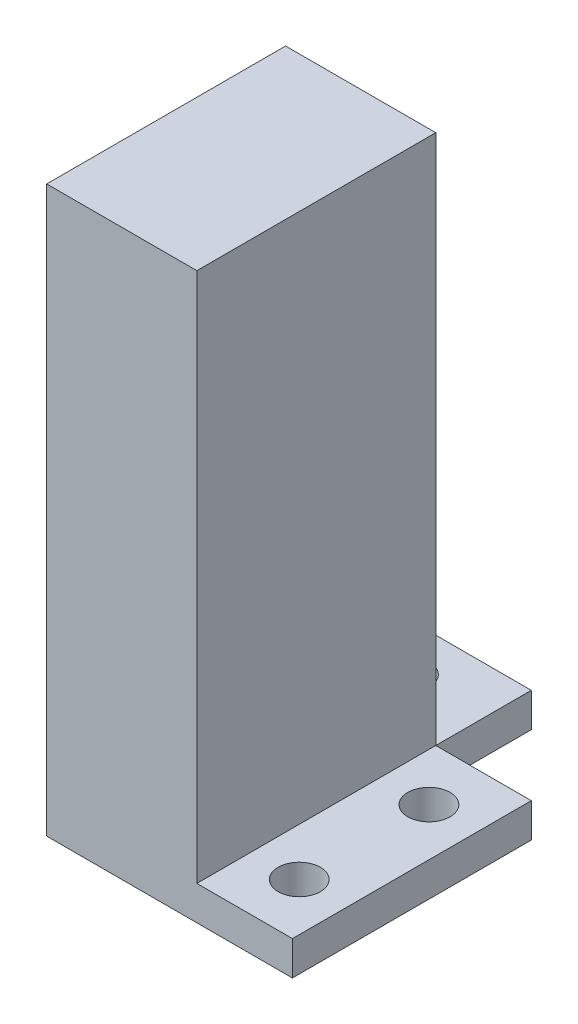
ISO-10303-21;
HEADER;
FILE_DESCRIPTION(('STEP AP214'),'2;1');
FILE_NAME('part.step','',(''),(''),'','','');
FILE_SCHEMA(('AUTOMOTIVE_DESIGN { 1 0 10303 214 1 1 1 1 }'));
ENDSEC;
DATA;
#1=APPLICATION_CONTEXT('core data for automotive mechanical design processes');
#2=APPLICATION_PROTOCOL_DEFINITION('international standard','automotive_design',2000,#1);
#3=PRODUCT_CONTEXT('',#1,'mechanical');
#4=PRODUCT('Part','Part','',(#3));
#5=PRODUCT_RELATED_PRODUCT_CATEGORY('part','',(#4));
#6=PRODUCT_DEFINITION_FORMATION('','',#4);
#7=PRODUCT_DEFINITION_CONTEXT('part definition',#1,'design');
#8=PRODUCT_DEFINITION('design','',#6,#7);
#9=PRODUCT_DEFINITION_SHAPE('','',#8);
#10=(LENGTH_UNIT() NAMED_UNIT(*) SI_UNIT(.MILLI.,.METRE.));
#11=(NAMED_UNIT(*) PLANE_ANGLE_UNIT() SI_UNIT($,.RADIAN.));
#12=(NAMED_UNIT(*) SI_UNIT($,.STERADIAN.) SOLID_ANGLE_UNIT());
#13=UNCERTAINTY_MEASURE_WITH_UNIT(LENGTH_MEASURE(1.E-05),#10,'distance_accuracy_value','');
#14=(GEOMETRIC_REPRESENTATION_CONTEXT(3) GLOBAL_UNCERTAINTY_ASSIGNED_CONTEXT((#13)) GLOBAL_UNIT_ASSIGNED_CONTEXT((#10,
#11,#12)) REPRESENTATION_CONTEXT('',''));
#15=CARTESIAN_POINT('',(0.,0.,0.));
#16=DIRECTION('',(0.,0.,1.));
#17=DIRECTION('',(1.,0.,0.));
#18=AXIS2_PLACEMENT_3D('',#15,#16,#17);
#19=CARTESIAN_POINT('',(11.,49.2196543089587,30.));
#20=DIRECTION('',(-1.,0.,0.));
#21=DIRECTION('',(0.,0.,1.));
#22=AXIS2_PLACEMENT_3D('',#19,#20,#21);
#23=PLANE('',#22);
#24=DIRECTION('',(0.,0.,1.));
#25=VECTOR('',#24,1.);
#26=CARTESIAN_POINT('',(11.,-28.5303456910413,0.));
#27=LINE('',#26,#25);
#28=CARTESIAN_POINT('',(11.,-28.5303456910413,0.));
#29=VERTEX_POINT('',#28);
#30=CARTESIAN_POINT('',(11.,-28.5303456910413,35.));
#31=VERTEX_POINT('',#30);
#32=EDGE_CURVE('E162',#29,#31,#27,.T.);
#33=ORIENTED_EDGE('',*,*,#32,.F.);
#34=DIRECTION('',(0.,1.,0.));
#35=VECTOR('',#34,1.);
#36=CARTESIAN_POINT('',(11.,49.2196543089587,0.));
#37=LINE('',#36,#35);
#38=CARTESIAN_POINT('',(11.,49.2196543089587,0.));
#39=VERTEX_POINT('',#38);
#40=EDGE_CURVE('E240',#29,#39,#37,.T.);
#41=ORIENTED_EDGE('',*,*,#40,.T.);
#42=DIRECTION('',(0.,0.,-1.));
#43=VECTOR('',#42,1.);
#44=CARTESIAN_POINT('',(11.,49.2196543089587,30.));
#45=LINE('',#44,#43);
#46=CARTESIAN_POINT('',(11.,49.2196543089587,35.));
#47=VERTEX_POINT('',#46);
#48=EDGE_CURVE('E243',#47,#39,#45,.T.);
#49=ORIENTED_EDGE('',*,*,#48,.F.);
#50=DIRECTION('',(0.,1.,0.));
#51=VECTOR('',#50,1.);
#52=CARTESIAN_POINT('',(11.,-33.5303456910413,35.));
#53=LINE('',#52,#51);
#54=EDGE_CURVE('E127',#31,#47,#53,.T.);
#55=ORIENTED_EDGE('',*,*,#54,.F.);
#56=EDGE_LOOP('',(#33,#41,#49,#55));
#57=FACE_BOUND('',#56,.T.);
#58=ADVANCED_FACE('F45',(#57),#23,.F.);
#59=CARTESIAN_POINT('',(0.,0.,0.));
#60=DIRECTION('',(0.,0.,1.));
#61=DIRECTION('',(1.,0.,0.));
#62=AXIS2_PLACEMENT_3D('',#59,#60,#61);
#63=PLANE('',#62);
#64=CARTESIAN_POINT('',(0.,7.71965430895869,0.));
#65=DIRECTION('',(0.,0.,1.));
#66=DIRECTION('',(1.,0.,0.));
#67=AXIS2_PLACEMENT_3D('',#64,#65,#66);
#68=CIRCLE('',#67,3.1);
#69=CARTESIAN_POINT('',(3.09999999999998,7.71965430895869,0.));
#70=VERTEX_POINT('',#69);
#71=EDGE_CURVE('E222',#70,#70,#68,.T.);
#72=ORIENTED_EDGE('',*,*,#71,.T.);
#73=EDGE_LOOP('',(#72));
#74=FACE_BOUND('',#73,.T.);
#75=CARTESIAN_POINT('',(0.,35.7196543089587,0.));
#76=DIRECTION('',(0.,0.,1.));
#77=DIRECTION('',(1.,0.,0.));
#78=AXIS2_PLACEMENT_3D('',#75,#76,#77);
#79=CIRCLE('',#78,3.1);
#80=CARTESIAN_POINT('',(3.09999999999998,35.7196543089587,0.));
#81=VERTEX_POINT('',#80);
#82=EDGE_CURVE('E226',#81,#81,#79,.T.);
#83=ORIENTED_EDGE('',*,*,#82,.T.);
#84=EDGE_LOOP('',(#83));
#85=FACE_BOUND('',#84,.T.);
#86=DIRECTION('',(1.,0.,0.));
#87=VECTOR('',#86,1.);
#88=CARTESIAN_POINT('',(0.,-28.5303456910413,0.));
#89=LINE('',#88,#87);
#90=CARTESIAN_POINT('',(-11.,-28.5303456910413,0.));
#91=VERTEX_POINT('',#90);
#92=EDGE_CURVE('E69',#91,#29,#89,.T.);
#93=ORIENTED_EDGE('',*,*,#92,.F.);
#94=DIRECTION('',(0.,-1.,0.));
#95=VECTOR('',#94,1.);
#96=CARTESIAN_POINT('',(-11.,49.2196543089587,0.));
#97=LINE('',#96,#95);
#98=CARTESIAN_POINT('',(-11.,49.2196543089587,0.));
#99=VERTEX_POINT('',#98);
#100=EDGE_CURVE('E237',#99,#91,#97,.T.);
#101=ORIENTED_EDGE('',*,*,#100,.F.);
#102=DIRECTION('',(-1.,0.,0.));
#103=VECTOR('',#102,1.);
#104=CARTESIAN_POINT('',(11.,49.2196543089587,0.));
#105=LINE('',#104,#103);
#106=EDGE_CURVE('E233',#39,#99,#105,.T.);
#107=ORIENTED_EDGE('',*,*,#106,.F.);
#108=ORIENTED_EDGE('',*,*,#40,.F.);
#109=EDGE_LOOP('',(#93,#101,#107,#108));
#110=FACE_BOUND('',#109,.T.);
#111=ADVANCED_FACE('F292',(#74,#85,#110),#63,.F.);
#112=CARTESIAN_POINT('',(11.,49.2196543089587,30.));
#113=DIRECTION('',(0.,-1.,0.));
#114=DIRECTION('',(0.,0.,-1.));
#115=AXIS2_PLACEMENT_3D('',#112,#113,#114);
#116=PLANE('',#115);
#117=ORIENTED_EDGE('',*,*,#106,.T.);
#118=DIRECTION('',(0.,0.,-1.));
#119=VECTOR('',#118,1.);
#120=CARTESIAN_POINT('',(-11.,49.2196543089587,30.));
#121=LINE('',#120,#119);
#122=CARTESIAN_POINT('',(-11.,49.2196543089587,35.));
#123=VERTEX_POINT('',#122);
#124=EDGE_CURVE('E11',#123,#99,#121,.T.);
#125=ORIENTED_EDGE('',*,*,#124,.F.);
#126=DIRECTION('',(-1.,0.,0.));
#127=VECTOR('',#126,1.);
#128=CARTESIAN_POINT('',(11.,49.2196543089587,35.));
#129=LINE('',#128,#127);
#130=EDGE_CURVE('E214',#47,#123,#129,.T.);
#131=ORIENTED_EDGE('',*,*,#130,.F.);
#132=ORIENTED_EDGE('',*,*,#48,.T.);
#133=EDGE_LOOP('',(#117,#125,#131,#132));
#134=FACE_BOUND('',#133,.T.);
#135=ADVANCED_FACE('F47',(#134),#116,.F.);
#136=CARTESIAN_POINT('',(-11.,49.2196543089587,30.));
#137=DIRECTION('',(1.,0.,0.));
#138=DIRECTION('',(0.,0.,-1.));
#139=AXIS2_PLACEMENT_3D('',#136,#137,#138);
#140=PLANE('',#139);
#141=ORIENTED_EDGE('',*,*,#100,.T.);
#142=DIRECTION('',(0.,0.,-1.));
#143=VECTOR('',#142,1.);
#144=CARTESIAN_POINT('',(-11.,-28.5303456910413,0.));
#145=LINE('',#144,#143);
#146=CARTESIAN_POINT('',(-11.,-28.5303456910413,-14.));
#147=VERTEX_POINT('',#146);
#148=EDGE_CURVE('E191',#91,#147,#145,.T.);
#149=ORIENTED_EDGE('',*,*,#148,.T.);
#150=DIRECTION('',(0.,-1.,0.));
#151=VECTOR('',#150,1.);
#152=CARTESIAN_POINT('',(-11.,-28.5303456910413,-14.));
#153=LINE('',#152,#151);
#154=CARTESIAN_POINT('',(-11.,-33.5303456910413,-14.));
#155=VERTEX_POINT('',#154);
#156=EDGE_CURVE('E198',#147,#155,#153,.T.);
#157=ORIENTED_EDGE('',*,*,#156,.T.);
#158=DIRECTION('',(0.,0.,-1.));
#159=VECTOR('',#158,1.);
#160=CARTESIAN_POINT('',(-11.,-33.5303456910413,30.));
#161=LINE('',#160,#159);
#162=CARTESIAN_POINT('',(-11.,-33.5303456910413,35.));
#163=VERTEX_POINT('',#162);
#164=EDGE_CURVE('E54',#163,#155,#161,.T.);
#165=ORIENTED_EDGE('',*,*,#164,.F.);
#166=DIRECTION('',(0.,-1.,0.));
#167=VECTOR('',#166,1.);
#168=CARTESIAN_POINT('',(-11.,49.2196543089587,35.));
#169=LINE('',#168,#167);
#170=EDGE_CURVE('E123',#123,#163,#169,.T.);
#171=ORIENTED_EDGE('',*,*,#170,.F.);
#172=ORIENTED_EDGE('',*,*,#124,.T.);
#173=EDGE_LOOP('',(#141,#149,#157,#165,#171,#172));
#174=FACE_BOUND('',#173,.T.);
#175=ADVANCED_FACE('F252',(#174),#140,.F.);
#176=CARTESIAN_POINT('',(-11.,-33.5303456910413,30.));
#177=DIRECTION('',(0.,1.,0.));
#178=DIRECTION('',(0.,0.,1.));
#179=AXIS2_PLACEMENT_3D('',#176,#177,#178);
#180=PLANE('',#179);
#181=ORIENTED_EDGE('',*,*,#164,.T.);
#182=DIRECTION('',(1.,0.,0.));
#183=VECTOR('',#182,1.);
#184=CARTESIAN_POINT('',(0.,-33.5303456910413,-14.));
#185=LINE('',#184,#183);
#186=CARTESIAN_POINT('',(11.,-33.5303456910413,-14.));
#187=VERTEX_POINT('',#186);
#188=EDGE_CURVE('E147',#155,#187,#185,.T.);
#189=ORIENTED_EDGE('',*,*,#188,.T.);
#190=DIRECTION('',(0.,0.,-1.));
#191=VECTOR('',#190,1.);
#192=CARTESIAN_POINT('',(11.,-33.5303456910413,30.));
#193=LINE('',#192,#191);
#194=CARTESIAN_POINT('',(11.,-33.5303456910413,0.));
#195=VERTEX_POINT('',#194);
#196=EDGE_CURVE('E247',#195,#187,#193,.T.);
#197=ORIENTED_EDGE('',*,*,#196,.F.);
#198=DIRECTION('',(1.,0.,0.));
#199=VECTOR('',#198,1.);
#200=CARTESIAN_POINT('',(0.,-33.5303456910413,0.));
#201=LINE('',#200,#199);
#202=CARTESIAN_POINT('',(25.,-33.5303456910413,0.));
#203=VERTEX_POINT('',#202);
#204=EDGE_CURVE('E61',#195,#203,#201,.T.);
#205=ORIENTED_EDGE('',*,*,#204,.T.);
#206=DIRECTION('',(0.,0.,1.));
#207=VECTOR('',#206,1.);
#208=CARTESIAN_POINT('',(25.,-33.5303456910413,0.));
#209=LINE('',#208,#207);
#210=CARTESIAN_POINT('',(25.,-33.5303456910413,35.));
#211=VERTEX_POINT('',#210);
#212=EDGE_CURVE('E132',#203,#211,#209,.T.);
#213=ORIENTED_EDGE('',*,*,#212,.T.);
#214=DIRECTION('',(1.,0.,0.));
#215=VECTOR('',#214,1.);
#216=CARTESIAN_POINT('',(-11.,-33.5303456910413,35.));
#217=LINE('',#216,#215);
#218=EDGE_CURVE('E116',#163,#211,#217,.T.);
#219=ORIENTED_EDGE('',*,*,#218,.F.);
#220=EDGE_LOOP('',(#181,#189,#197,#205,#213,#219));
#221=FACE_BOUND('',#220,.T.);
#222=CARTESIAN_POINT('',(0.,-33.5303456910413,-7.));
#223=DIRECTION('',(0.,-1.,0.));
#224=DIRECTION('',(0.,0.,-1.));
#225=AXIS2_PLACEMENT_3D('',#222,#223,#224);
#226=CIRCLE('',#225,3.1);
#227=CARTESIAN_POINT('',(0.,-33.5303456910413,-10.1));
#228=VERTEX_POINT('',#227);
#229=EDGE_CURVE('E142',#228,#228,#226,.T.);
#230=ORIENTED_EDGE('',*,*,#229,.F.);
#231=EDGE_LOOP('',(#230));
#232=FACE_BOUND('',#231,.T.);
#233=CARTESIAN_POINT('',(18.,-33.5303456910413,27.));
#234=DIRECTION('',(0.,-1.,0.));
#235=DIRECTION('',(0.,0.,-1.));
#236=AXIS2_PLACEMENT_3D('',#233,#234,#235);
#237=CIRCLE('',#236,3.1);
#238=CARTESIAN_POINT('',(18.,-33.5303456910413,23.9));
#239=VERTEX_POINT('',#238);
#240=EDGE_CURVE('E158',#239,#239,#237,.T.);
#241=ORIENTED_EDGE('',*,*,#240,.F.);
#242=EDGE_LOOP('',(#241));
#243=FACE_BOUND('',#242,.T.);
#244=CARTESIAN_POINT('',(18.,-33.5303456910413,8.));
#245=DIRECTION('',(0.,-1.,0.));
#246=DIRECTION('',(0.,0.,-1.));
#247=AXIS2_PLACEMENT_3D('',#244,#245,#246);
#248=CIRCLE('',#247,3.1);
#249=CARTESIAN_POINT('',(18.,-33.5303456910413,4.9));
#250=VERTEX_POINT('',#249);
#251=EDGE_CURVE('E154',#250,#250,#248,.T.);
#252=ORIENTED_EDGE('',*,*,#251,.F.);
#253=EDGE_LOOP('',(#252));
#254=FACE_BOUND('',#253,.T.);
#255=ADVANCED_FACE('F138',(#221,#232,#243,#254),#180,.F.);
#256=DIRECTION('',(0.,0.,-1.));
#257=VECTOR('',#256,1.);
#258=CARTESIAN_POINT('',(11.,-28.5303456910413,0.));
#259=LINE('',#258,#257);
#260=CARTESIAN_POINT('',(11.,-28.5303456910413,-14.));
#261=VERTEX_POINT('',#260);
#262=EDGE_CURVE('E186',#29,#261,#259,.T.);
#263=ORIENTED_EDGE('',*,*,#262,.F.);
#264=DIRECTION('',(0.,-1.,0.));
#265=VECTOR('',#264,1.);
#266=CARTESIAN_POINT('',(11.,-28.5303456910413,0.));
#267=LINE('',#266,#265);
#268=EDGE_CURVE('E152',#29,#195,#267,.T.);
#269=ORIENTED_EDGE('',*,*,#268,.T.);
#270=ORIENTED_EDGE('',*,*,#196,.T.);
#271=DIRECTION('',(0.,-1.,0.));
#272=VECTOR('',#271,1.);
#273=CARTESIAN_POINT('',(11.,-28.5303456910413,-14.));
#274=LINE('',#273,#272);
#275=EDGE_CURVE('E203',#261,#187,#274,.T.);
#276=ORIENTED_EDGE('',*,*,#275,.F.);
#277=EDGE_LOOP('',(#263,#269,#270,#276));
#278=FACE_BOUND('',#277,.T.);
#279=ADVANCED_FACE('F260',(#278),#23,.F.);
#280=CARTESIAN_POINT('',(0.,35.7196543089587,30.));
#281=DIRECTION('',(0.,0.,-1.));
#282=DIRECTION('',(-1.,0.,0.));
#283=AXIS2_PLACEMENT_3D('',#280,#281,#282);
#284=CYLINDRICAL_SURFACE('',#283,3.1);
#285=CARTESIAN_POINT('',(0.,35.7196543089587,30.));
#286=DIRECTION('',(0.,0.,1.));
#287=DIRECTION('',(1.,0.,0.));
#288=AXIS2_PLACEMENT_3D('',#285,#286,#287);
#289=CIRCLE('',#288,3.1);
#290=CARTESIAN_POINT('',(3.09999999999998,35.7196543089587,30.));
#291=VERTEX_POINT('',#290);
#292=EDGE_CURVE('E221',#291,#291,#289,.T.);
#293=ORIENTED_EDGE('',*,*,#292,.T.);
#294=EDGE_LOOP('',(#293));
#295=FACE_BOUND('',#294,.T.);
#296=ORIENTED_EDGE('',*,*,#82,.F.);
#297=EDGE_LOOP('',(#296));
#298=FACE_BOUND('',#297,.T.);
#299=ADVANCED_FACE('F301',(#295,#298),#284,.F.);
#300=CARTESIAN_POINT('',(0.,7.71965430895869,30.));
#301=DIRECTION('',(0.,0.,-1.));
#302=DIRECTION('',(-1.,0.,0.));
#303=AXIS2_PLACEMENT_3D('',#300,#301,#302);
#304=CYLINDRICAL_SURFACE('',#303,3.1);
#305=CARTESIAN_POINT('',(0.,7.71965430895869,30.));
#306=DIRECTION('',(0.,0.,1.));
#307=DIRECTION('',(1.,0.,0.));
#308=AXIS2_PLACEMENT_3D('',#305,#306,#307);
#309=CIRCLE('',#308,3.1);
#310=CARTESIAN_POINT('',(3.09999999999998,7.71965430895869,30.));
#311=VERTEX_POINT('',#310);
#312=EDGE_CURVE('E217',#311,#311,#309,.T.);
#313=ORIENTED_EDGE('',*,*,#312,.T.);
#314=EDGE_LOOP('',(#313));
#315=FACE_BOUND('',#314,.T.);
#316=ORIENTED_EDGE('',*,*,#71,.F.);
#317=EDGE_LOOP('',(#316));
#318=FACE_BOUND('',#317,.T.);
#319=ADVANCED_FACE('F306',(#315,#318),#304,.F.);
#320=CARTESIAN_POINT('',(0.,0.,30.));
#321=DIRECTION('',(0.,0.,1.));
#322=DIRECTION('',(1.,0.,0.));
#323=AXIS2_PLACEMENT_3D('',#320,#321,#322);
#324=PLANE('',#323);
#325=ORIENTED_EDGE('',*,*,#312,.F.);
#326=EDGE_LOOP('',(#325));
#327=FACE_BOUND('',#326,.T.);
#328=ADVANCED_FACE('F449',(#327),#324,.F.);
#329=ORIENTED_EDGE('',*,*,#292,.F.);
#330=EDGE_LOOP('',(#329));
#331=FACE_BOUND('',#330,.T.);
#332=ADVANCED_FACE('F352',(#331),#324,.F.);
#333=CARTESIAN_POINT('',(0.,0.,35.));
#334=DIRECTION('',(0.,0.,1.));
#335=DIRECTION('',(1.,0.,0.));
#336=AXIS2_PLACEMENT_3D('',#333,#334,#335);
#337=PLANE('',#336);
#338=ORIENTED_EDGE('',*,*,#170,.T.);
#339=ORIENTED_EDGE('',*,*,#218,.T.);
#340=DIRECTION('',(0.,-1.,0.));
#341=VECTOR('',#340,1.);
#342=CARTESIAN_POINT('',(25.,-28.5303456910413,35.));
#343=LINE('',#342,#341);
#344=CARTESIAN_POINT('',(25.,-28.5303456910413,35.));
#345=VERTEX_POINT('',#344);
#346=EDGE_CURVE('E119',#345,#211,#343,.T.);
#347=ORIENTED_EDGE('',*,*,#346,.F.);
#348=DIRECTION('',(1.,0.,0.));
#349=VECTOR('',#348,1.);
#350=CARTESIAN_POINT('',(0.,-28.5303456910413,35.));
#351=LINE('',#350,#349);
#352=EDGE_CURVE('E149',#31,#345,#351,.T.);
#353=ORIENTED_EDGE('',*,*,#352,.F.);
#354=ORIENTED_EDGE('',*,*,#54,.T.);
#355=ORIENTED_EDGE('',*,*,#130,.T.);
#356=EDGE_LOOP('',(#338,#339,#347,#353,#354,#355));
#357=FACE_BOUND('',#356,.T.);
#358=ADVANCED_FACE('F118',(#357),#337,.T.);
#359=CARTESIAN_POINT('',(0.,-28.5303456910413,-14.));
#360=DIRECTION('',(0.,0.,-1.));
#361=DIRECTION('',(-1.,0.,0.));
#362=AXIS2_PLACEMENT_3D('',#359,#360,#361);
#363=PLANE('',#362);
#364=ORIENTED_EDGE('',*,*,#188,.F.);
#365=ORIENTED_EDGE('',*,*,#156,.F.);
#366=DIRECTION('',(1.,0.,0.));
#367=VECTOR('',#366,1.);
#368=CARTESIAN_POINT('',(0.,-28.5303456910413,-14.));
#369=LINE('',#368,#367);
#370=EDGE_CURVE('E195',#147,#261,#369,.T.);
#371=ORIENTED_EDGE('',*,*,#370,.T.);
#372=ORIENTED_EDGE('',*,*,#275,.T.);
#373=EDGE_LOOP('',(#364,#365,#371,#372));
#374=FACE_BOUND('',#373,.T.);
#375=ADVANCED_FACE('F256',(#374),#363,.T.);
#376=CARTESIAN_POINT('',(0.,-28.5303456910413,-7.));
#377=DIRECTION('',(0.,-1.,0.));
#378=DIRECTION('',(0.,0.,-1.));
#379=AXIS2_PLACEMENT_3D('',#376,#377,#378);
#380=CYLINDRICAL_SURFACE('',#379,3.1);
#381=CARTESIAN_POINT('',(0.,-28.5303456910413,-7.));
#382=DIRECTION('',(0.,-1.,0.));
#383=DIRECTION('',(0.,0.,-1.));
#384=AXIS2_PLACEMENT_3D('',#381,#382,#383);
#385=CIRCLE('',#384,3.1);
#386=CARTESIAN_POINT('',(0.,-28.5303456910413,-10.1));
#387=VERTEX_POINT('',#386);
#388=EDGE_CURVE('E182',#387,#387,#385,.T.);
#389=ORIENTED_EDGE('',*,*,#388,.F.);
#390=EDGE_LOOP('',(#389));
#391=FACE_BOUND('',#390,.T.);
#392=ORIENTED_EDGE('',*,*,#229,.T.);
#393=EDGE_LOOP('',(#392));
#394=FACE_BOUND('',#393,.T.);
#395=ADVANCED_FACE('F278',(#391,#394),#380,.F.);
#396=CARTESIAN_POINT('',(0.,-28.5303456910413,0.));
#397=DIRECTION('',(0.,-1.,0.));
#398=DIRECTION('',(0.,0.,-1.));
#399=AXIS2_PLACEMENT_3D('',#396,#397,#398);
#400=PLANE('',#399);
#401=ORIENTED_EDGE('',*,*,#388,.T.);
#402=EDGE_LOOP('',(#401));
#403=FACE_BOUND('',#402,.T.);
#404=ORIENTED_EDGE('',*,*,#262,.T.);
#405=ORIENTED_EDGE('',*,*,#370,.F.);
#406=ORIENTED_EDGE('',*,*,#148,.F.);
#407=ORIENTED_EDGE('',*,*,#92,.T.);
#408=EDGE_LOOP('',(#404,#405,#406,#407));
#409=FACE_BOUND('',#408,.T.);
#410=ADVANCED_FACE('F276',(#403,#409),#400,.F.);
#411=CARTESIAN_POINT('',(0.,-28.5303456910413,0.));
#412=DIRECTION('',(0.,0.,-1.));
#413=DIRECTION('',(-1.,0.,0.));
#414=AXIS2_PLACEMENT_3D('',#411,#412,#413);
#415=PLANE('',#414);
#416=ORIENTED_EDGE('',*,*,#204,.F.);
#417=ORIENTED_EDGE('',*,*,#268,.F.);
#418=DIRECTION('',(1.,0.,0.));
#419=VECTOR('',#418,1.);
#420=CARTESIAN_POINT('',(0.,-28.5303456910413,0.));
#421=LINE('',#420,#419);
#422=CARTESIAN_POINT('',(25.,-28.5303456910413,0.));
#423=VERTEX_POINT('',#422);
#424=EDGE_CURVE('E171',#29,#423,#421,.T.);
#425=ORIENTED_EDGE('',*,*,#424,.T.);
#426=DIRECTION('',(0.,-1.,0.));
#427=VECTOR('',#426,1.);
#428=CARTESIAN_POINT('',(25.,-28.5303456910413,0.));
#429=LINE('',#428,#427);
#430=EDGE_CURVE('E175',#423,#203,#429,.T.);
#431=ORIENTED_EDGE('',*,*,#430,.T.);
#432=EDGE_LOOP('',(#416,#417,#425,#431));
#433=FACE_BOUND('',#432,.T.);
#434=ADVANCED_FACE('F265',(#433),#415,.T.);
#435=CARTESIAN_POINT('',(18.,-28.5303456910413,8.));
#436=DIRECTION('',(0.,-1.,0.));
#437=DIRECTION('',(0.,0.,-1.));
#438=AXIS2_PLACEMENT_3D('',#435,#436,#437);
#439=CYLINDRICAL_SURFACE('',#438,3.1);
#440=CARTESIAN_POINT('',(18.,-28.5303456910413,8.));
#441=DIRECTION('',(0.,-1.,0.));
#442=DIRECTION('',(0.,0.,-1.));
#443=AXIS2_PLACEMENT_3D('',#440,#441,#442);
#444=CIRCLE('',#443,3.1);
#445=CARTESIAN_POINT('',(18.,-28.5303456910413,4.9));
#446=VERTEX_POINT('',#445);
#447=EDGE_CURVE('E166',#446,#446,#444,.T.);
#448=ORIENTED_EDGE('',*,*,#447,.F.);
#449=EDGE_LOOP('',(#448));
#450=FACE_BOUND('',#449,.T.);
#451=ORIENTED_EDGE('',*,*,#251,.T.);
#452=EDGE_LOOP('',(#451));
#453=FACE_BOUND('',#452,.T.);
#454=ADVANCED_FACE('F285',(#450,#453),#439,.F.);
#455=CARTESIAN_POINT('',(18.,-28.5303456910413,27.));
#456=DIRECTION('',(0.,-1.,0.));
#457=DIRECTION('',(0.,0.,-1.));
#458=AXIS2_PLACEMENT_3D('',#455,#456,#457);
#459=CYLINDRICAL_SURFACE('',#458,3.1);
#460=CARTESIAN_POINT('',(18.,-28.5303456910413,27.));
#461=DIRECTION('',(0.,-1.,0.));
#462=DIRECTION('',(0.,0.,-1.));
#463=AXIS2_PLACEMENT_3D('',#460,#461,#462);
#464=CIRCLE('',#463,3.1);
#465=CARTESIAN_POINT('',(18.,-28.5303456910413,23.9));
#466=VERTEX_POINT('',#465);
#467=EDGE_CURVE('E136',#466,#466,#464,.T.);
#468=ORIENTED_EDGE('',*,*,#467,.F.);
#469=EDGE_LOOP('',(#468));
#470=FACE_BOUND('',#469,.T.);
#471=ORIENTED_EDGE('',*,*,#240,.T.);
#472=EDGE_LOOP('',(#471));
#473=FACE_BOUND('',#472,.T.);
#474=ADVANCED_FACE('F390',(#470,#473),#459,.F.);
#475=CARTESIAN_POINT('',(25.,-28.5303456910413,0.));
#476=DIRECTION('',(1.,0.,0.));
#477=DIRECTION('',(0.,0.,-1.));
#478=AXIS2_PLACEMENT_3D('',#475,#476,#477);
#479=PLANE('',#478);
#480=ORIENTED_EDGE('',*,*,#212,.F.);
#481=ORIENTED_EDGE('',*,*,#430,.F.);
#482=DIRECTION('',(0.,0.,1.));
#483=VECTOR('',#482,1.);
#484=CARTESIAN_POINT('',(25.,-28.5303456910413,0.));
#485=LINE('',#484,#483);
#486=EDGE_CURVE('E134',#423,#345,#485,.T.);
#487=ORIENTED_EDGE('',*,*,#486,.T.);
#488=ORIENTED_EDGE('',*,*,#346,.T.);
#489=EDGE_LOOP('',(#480,#481,#487,#488));
#490=FACE_BOUND('',#489,.T.);
#491=ADVANCED_FACE('F131',(#490),#479,.T.);
#492=CARTESIAN_POINT('',(0.,-28.5303456910413,0.));
#493=DIRECTION('',(0.,-1.,0.));
#494=DIRECTION('',(0.,0.,-1.));
#495=AXIS2_PLACEMENT_3D('',#492,#493,#494);
#496=PLANE('',#495);
#497=ORIENTED_EDGE('',*,*,#467,.T.);
#498=EDGE_LOOP('',(#497));
#499=FACE_BOUND('',#498,.T.);
#500=ORIENTED_EDGE('',*,*,#447,.T.);
#501=EDGE_LOOP('',(#500));
#502=FACE_BOUND('',#501,.T.);
#503=ORIENTED_EDGE('',*,*,#424,.F.);
#504=ORIENTED_EDGE('',*,*,#32,.T.);
#505=ORIENTED_EDGE('',*,*,#352,.T.);
#506=ORIENTED_EDGE('',*,*,#486,.F.);
#507=EDGE_LOOP('',(#503,#504,#505,#506));
#508=FACE_BOUND('',#507,.T.);
#509=ADVANCED_FACE('F267',(#499,#502,#508),#496,.F.);
#510=CLOSED_SHELL('',(#58,#111,#135,#175,#255,#279,#299,#319,#328,#332,#358,#375,#395,#410,#434,
#454,#474,#491,#509));
#511=MANIFOLD_SOLID_BREP('B2',#510);
#512=ADVANCED_BREP_SHAPE_REPRESENTATION('',(#18,#511),#14);
#513=SHAPE_DEFINITION_REPRESENTATION(#9,#512);
ENDSEC;
END-ISO-10303-21;
